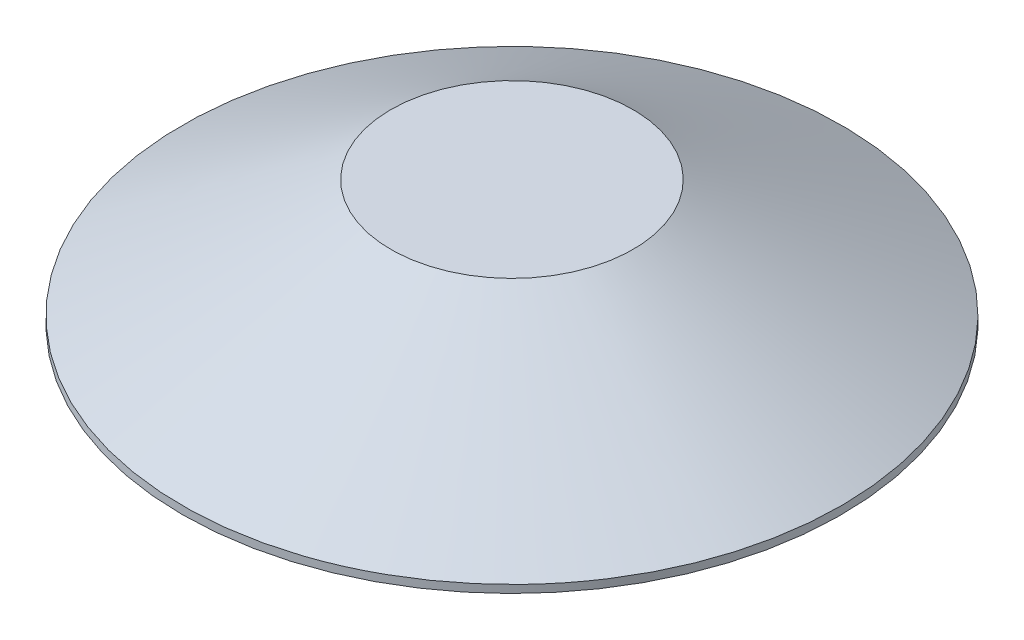
ISO-10303-21;
HEADER;
FILE_DESCRIPTION(('STEP AP214'),'2;1');
FILE_NAME('part.step','',(''),(''),'','','');
FILE_SCHEMA(('AUTOMOTIVE_DESIGN { 1 0 10303 214 1 1 1 1 }'));
ENDSEC;
DATA;
#1=APPLICATION_CONTEXT('core data for automotive mechanical design processes');
#2=APPLICATION_PROTOCOL_DEFINITION('international standard','automotive_design',2000,#1);
#3=PRODUCT_CONTEXT('',#1,'mechanical');
#4=PRODUCT('Part','Part','',(#3));
#5=PRODUCT_RELATED_PRODUCT_CATEGORY('part','',(#4));
#6=PRODUCT_DEFINITION_FORMATION('','',#4);
#7=PRODUCT_DEFINITION_CONTEXT('part definition',#1,'design');
#8=PRODUCT_DEFINITION('design','',#6,#7);
#9=PRODUCT_DEFINITION_SHAPE('','',#8);
#10=(LENGTH_UNIT() NAMED_UNIT(*) SI_UNIT(.MILLI.,.METRE.));
#11=(NAMED_UNIT(*) PLANE_ANGLE_UNIT() SI_UNIT($,.RADIAN.));
#12=(NAMED_UNIT(*) SI_UNIT($,.STERADIAN.) SOLID_ANGLE_UNIT());
#13=UNCERTAINTY_MEASURE_WITH_UNIT(LENGTH_MEASURE(1.E-05),#10,'distance_accuracy_value','');
#14=(GEOMETRIC_REPRESENTATION_CONTEXT(3) GLOBAL_UNCERTAINTY_ASSIGNED_CONTEXT((#13)) GLOBAL_UNIT_ASSIGNED_CONTEXT((#10,
#11,#12)) REPRESENTATION_CONTEXT('',''));
#15=CARTESIAN_POINT('',(0.,0.,0.));
#16=DIRECTION('',(0.,0.,1.));
#17=DIRECTION('',(1.,0.,0.));
#18=AXIS2_PLACEMENT_3D('',#15,#16,#17);
#19=CARTESIAN_POINT('',(0.,100.,0.));
#20=DIRECTION('',(0.,-1.,0.));
#21=DIRECTION('',(0.,0.,-1.));
#22=AXIS2_PLACEMENT_3D('',#19,#20,#21);
#23=CYLINDRICAL_SURFACE('',#22,4200.);
#24=CARTESIAN_POINT('',(0.,100.,0.));
#25=DIRECTION('',(0.,-1.,0.));
#26=DIRECTION('',(0.,0.,-1.));
#27=AXIS2_PLACEMENT_3D('',#24,#25,#26);
#28=CIRCLE('',#27,4200.);
#29=CARTESIAN_POINT('',(-2566.07901182793,100.,-3324.94187995162));
#30=VERTEX_POINT('',#29);
#31=EDGE_CURVE('E11',#30,#30,#28,.F.);
#32=ORIENTED_EDGE('',*,*,#31,.F.);
#33=EDGE_LOOP('',(#32));
#34=FACE_BOUND('',#33,.T.);
#35=CARTESIAN_POINT('',(0.,0.,0.));
#36=DIRECTION('',(0.,1.,0.));
#37=DIRECTION('',(0.,0.,1.));
#38=AXIS2_PLACEMENT_3D('',#35,#36,#37);
#39=CIRCLE('',#38,4200.);
#40=CARTESIAN_POINT('',(0.,0.,4200.));
#41=VERTEX_POINT('',#40);
#42=EDGE_CURVE('E39',#41,#41,#39,.T.);
#43=ORIENTED_EDGE('',*,*,#42,.T.);
#44=EDGE_LOOP('',(#43));
#45=FACE_BOUND('',#44,.T.);
#46=ADVANCED_FACE('F32',(#34,#45),#23,.T.);
#47=CARTESIAN_POINT('',(0.,0.,0.));
#48=DIRECTION('',(0.,1.,0.));
#49=DIRECTION('',(0.,0.,1.));
#50=AXIS2_PLACEMENT_3D('',#47,#48,#49);
#51=PLANE('',#50);
#52=ORIENTED_EDGE('',*,*,#42,.F.);
#53=EDGE_LOOP('',(#52));
#54=FACE_BOUND('',#53,.T.);
#55=ADVANCED_FACE('F65',(#54),#51,.F.);
#56=CARTESIAN_POINT('',(0.,1600.,0.));
#57=DIRECTION('',(0.,1.,0.));
#58=DIRECTION('',(0.,0.,1.));
#59=AXIS2_PLACEMENT_3D('',#56,#57,#58);
#60=PLANE('',#59);
#61=CARTESIAN_POINT('',(0.,1600.,0.));
#62=DIRECTION('',(0.,1.,0.));
#63=DIRECTION('',(0.,0.,1.));
#64=AXIS2_PLACEMENT_3D('',#61,#62,#63);
#65=CIRCLE('',#64,1543.98613841472);
#66=CARTESIAN_POINT('',(-1266.54976607841,1600.,-883.031644769033));
#67=VERTEX_POINT('',#66);
#68=EDGE_CURVE('E43',#67,#67,#65,.T.);
#69=ORIENTED_EDGE('',*,*,#68,.T.);
#70=EDGE_LOOP('',(#69));
#71=FACE_BOUND('',#70,.T.);
#72=ADVANCED_FACE('F55',(#71),#60,.T.);
#73=CARTESIAN_POINT('',(-1266.54976607841,1600.,-883.031644769033));
#74=CARTESIAN_POINT('',(-2566.07901182793,100.,-3324.94187995162));
#75=CARTESIAN_POINT('',(499.513523459652,1600.,-3416.13117692586));
#76=CARTESIAN_POINT('',(4083.80474807531,100.,-8457.09990360748));
#77=CARTESIAN_POINT('',(3032.61305561648,1600.,-1650.06788738779));
#78=CARTESIAN_POINT('',(9215.96277173116,100.,-1807.21614370424));
#79=CARTESIAN_POINT('',(1266.54976607841,1600.,883.031644769033));
#80=CARTESIAN_POINT('',(2566.07901182793,100.,3324.94187995162));
#81=CARTESIAN_POINT('',(-499.513523459651,1600.,3416.13117692586));
#82=CARTESIAN_POINT('',(-4083.80474807531,100.,8457.09990360748));
#83=CARTESIAN_POINT('',(-3032.61305561648,1600.,1650.06788738779));
#84=CARTESIAN_POINT('',(-9215.96277173116,100.,1807.21614370424));
#85=CARTESIAN_POINT('',(-1266.54976607841,1600.,-883.031644769033));
#86=CARTESIAN_POINT('',(-2566.07901182793,100.,-3324.94187995162));
#87=(BOUNDED_SURFACE() B_SPLINE_SURFACE(3,1,((#73,#74),(#75,#76),(#77,#78),(#79,#80),(#81,#82),
(#83,#84),(#85,#86)),.UNSPECIFIED.,.T.,.F.,.F.) B_SPLINE_SURFACE_WITH_KNOTS((4,3,4),(2,2),(0.,
0.5,1.),(0.,1.),.UNSPECIFIED.) GEOMETRIC_REPRESENTATION_ITEM() RATIONAL_B_SPLINE_SURFACE(((1.,
1.),(0.333333333333333,0.333333333333333),(0.333333333333333,0.333333333333333),(1.,1.),
(0.333333333333333,0.333333333333333),(0.333333333333333,0.333333333333333),(1.,1.))) REPRESENTATION_ITEM('') SURFACE());
#88=CARTESIAN_POINT('',(-1266.54976607841,1600.,-883.031644769033));
#89=CARTESIAN_POINT('',(-1280.08652905497,1584.375,-908.468209718851));
#90=CARTESIAN_POINT('',(-1293.62329203153,1568.75,-933.90477466867));
#91=CARTESIAN_POINT('',(-1320.69681798464,1537.5,-984.777904568307));
#92=CARTESIAN_POINT('',(-1334.2335809612,1521.875,-1010.21446951813));
#93=CARTESIAN_POINT('',(-1361.30710691432,1490.625,-1061.08759941776));
#94=CARTESIAN_POINT('',(-1374.84386989087,1475.,-1086.52416436758));
#95=CARTESIAN_POINT('',(-1401.91739584399,1443.75,-1137.39729426722));
#96=CARTESIAN_POINT('',(-1415.45415882055,1428.125,-1162.83385921704));
#97=CARTESIAN_POINT('',(-1442.52768477366,1396.875,-1213.70698911667));
#98=CARTESIAN_POINT('',(-1456.06444775022,1381.25,-1239.14355406649));
#99=CARTESIAN_POINT('',(-1483.13797370333,1350.,-1290.01668396613));
#100=CARTESIAN_POINT('',(-1496.67473667989,1334.375,-1315.45324891595));
#101=CARTESIAN_POINT('',(-1523.74826263301,1303.125,-1366.32637881559));
#102=CARTESIAN_POINT('',(-1537.28502560956,1287.5,-1391.7629437654));
#103=CARTESIAN_POINT('',(-1564.35855156268,1256.25,-1442.63607366504));
#104=CARTESIAN_POINT('',(-1577.89531453923,1240.625,-1468.07263861486));
#105=CARTESIAN_POINT('',(-1604.96884049235,1209.375,-1518.9457685145));
#106=CARTESIAN_POINT('',(-1618.50560346891,1193.75,-1544.38233346432));
#107=CARTESIAN_POINT('',(-1645.57912942202,1162.5,-1595.25546336395));
#108=CARTESIAN_POINT('',(-1659.11589239858,1146.875,-1620.69202831377));
#109=CARTESIAN_POINT('',(-1686.18941835169,1115.625,-1671.56515821341));
#110=CARTESIAN_POINT('',(-1699.72618132825,1100.,-1697.00172316323));
#111=CARTESIAN_POINT('',(-1726.79970728137,1068.75,-1747.87485306287));
#112=CARTESIAN_POINT('',(-1740.33647025792,1053.125,-1773.31141801268));
#113=CARTESIAN_POINT('',(-1767.40999621104,1021.875,-1824.18454791232));
#114=CARTESIAN_POINT('',(-1780.9467591876,1006.25,-1849.62111286214));
#115=CARTESIAN_POINT('',(-1808.02028514071,975.,-1900.49424276178));
#116=CARTESIAN_POINT('',(-1821.55704811727,959.375,-1925.9308077116));
#117=CARTESIAN_POINT('',(-1848.63057407038,928.125,-1976.80393761123));
#118=CARTESIAN_POINT('',(-1862.16733704694,912.5,-2002.24050256105));
#119=CARTESIAN_POINT('',(-1889.24086300006,881.25,-2053.11363246069));
#120=CARTESIAN_POINT('',(-1902.77762597661,865.625,-2078.55019741051));
#121=CARTESIAN_POINT('',(-1929.85115192973,834.375,-2129.42332731014));
#122=CARTESIAN_POINT('',(-1943.38791490629,818.75,-2154.85989225996));
#123=CARTESIAN_POINT('',(-1970.4614408594,787.5,-2205.7330221596));
#124=CARTESIAN_POINT('',(-1983.99820383596,771.875,-2231.16958710942));
#125=CARTESIAN_POINT('',(-2011.07172978907,740.625,-2282.04271700906));
#126=CARTESIAN_POINT('',(-2024.60849276563,725.,-2307.47928195887));
#127=CARTESIAN_POINT('',(-2051.68201871875,693.75,-2358.35241185851));
#128=CARTESIAN_POINT('',(-2065.2187816953,678.125,-2383.78897680833));
#129=CARTESIAN_POINT('',(-2092.29230764842,646.875,-2434.66210670797));
#130=CARTESIAN_POINT('',(-2105.82907062498,631.25,-2460.09867165779));
#131=CARTESIAN_POINT('',(-2132.90259657809,600.,-2510.97180155742));
#132=CARTESIAN_POINT('',(-2146.43935955465,584.375,-2536.40836650724));
#133=CARTESIAN_POINT('',(-2173.51288550776,553.125,-2587.28149640688));
#134=CARTESIAN_POINT('',(-2187.04964848432,537.5,-2612.7180613567));
#135=CARTESIAN_POINT('',(-2214.12317443744,506.25,-2663.59119125633));
#136=CARTESIAN_POINT('',(-2227.65993741399,490.625,-2689.02775620615));
#137=CARTESIAN_POINT('',(-2254.73346336711,459.375,-2739.90088610579));
#138=CARTESIAN_POINT('',(-2268.27022634367,443.75,-2765.33745105561));
#139=CARTESIAN_POINT('',(-2295.34375229678,412.5,-2816.21058095525));
#140=CARTESIAN_POINT('',(-2308.88051527334,396.875,-2841.64714590506));
#141=CARTESIAN_POINT('',(-2335.95404122645,365.625,-2892.5202758047));
#142=CARTESIAN_POINT('',(-2349.49080420301,350.,-2917.95684075452));
#143=CARTESIAN_POINT('',(-2376.56433015612,318.75,-2968.82997065416));
#144=CARTESIAN_POINT('',(-2390.10109313268,303.125,-2994.26653560398));
#145=CARTESIAN_POINT('',(-2417.1746190858,271.875,-3045.13966550361));
#146=CARTESIAN_POINT('',(-2430.71138206235,256.25,-3070.57623045343));
#147=CARTESIAN_POINT('',(-2457.78490801547,225.,-3121.44936035307));
#148=CARTESIAN_POINT('',(-2471.32167099203,209.375,-3146.88592530289));
#149=CARTESIAN_POINT('',(-2498.39519694514,178.125,-3197.75905520253));
#150=CARTESIAN_POINT('',(-2511.9319599217,162.5,-3223.19562015234));
#151=CARTESIAN_POINT('',(-2539.00548587481,131.25,-3274.06875005198));
#152=CARTESIAN_POINT('',(-2552.54224885137,115.625,-3299.5053150018));
#153=CARTESIAN_POINT('',(-2566.07901182793,100.,-3324.94187995162));
#154=B_SPLINE_CURVE_WITH_KNOTS('',3,(#88,#89,#90,#91,#92,#93,#94,#95,#96,#97,#98,#99,#100,#101,
#102,#103,#104,#105,#106,#107,#108,#109,#110,#111,#112,#113,#114,#115,#116,#117,#118,#119,#120,
#121,#122,#123,#124,#125,#126,#127,#128,#129,#130,#131,#132,#133,#134,#135,#136,#137,#138,#139,
#140,#141,#142,#143,#144,#145,#146,#147,#148,#149,#150,#151,#152,#153),.UNSPECIFIED.,.F.,.F.,(4,
2,2,2,2,2,2,2,2,2,2,2,2,2,2,2,2,2,2,2,2,2,2,2,2,2,2,2,2,2,2,2,4),(0.,98.3342804924535,
196.668560984907,295.002841477361,393.337121969814,491.671402462268,590.005682954721,
688.339963447175,786.674243939628,885.008524432082,983.342804924535,1081.67708541699,
1180.01136590944,1278.3456464019,1376.67992689435,1475.0142073868,1573.34848787926,
1671.68276837171,1770.01704886416,1868.35132935662,1966.68560984907,2065.01989034152,
2163.35417083398,2261.68845132643,2360.02273181888,2458.35701231134,2556.69129280379,
2655.02557329625,2753.3598537887,2851.69413428115,2950.02841477361,3048.36269526606,
3146.69697575851),.UNSPECIFIED.);
#155=EDGE_CURVE('BSEAM64',#67,#30,#154,.T.);
#156=ORIENTED_EDGE('',*,*,#68,.F.);
#157=ORIENTED_EDGE('',*,*,#31,.T.);
#158=ORIENTED_EDGE('',*,*,#155,.T.);
#159=ORIENTED_EDGE('',*,*,#155,.F.);
#160=EDGE_LOOP('',(#156,#158,#157,#159));
#161=FACE_BOUND('',#160,.T.);
#162=ADVANCED_FACE('F64',(#161),#87,.T.);
#163=CLOSED_SHELL('',(#46,#55,#72,#162));
#164=MANIFOLD_SOLID_BREP('B2',#163);
#165=ADVANCED_BREP_SHAPE_REPRESENTATION('',(#18,#164),#14);
#166=SHAPE_DEFINITION_REPRESENTATION(#9,#165);
ENDSEC;
END-ISO-10303-21;
